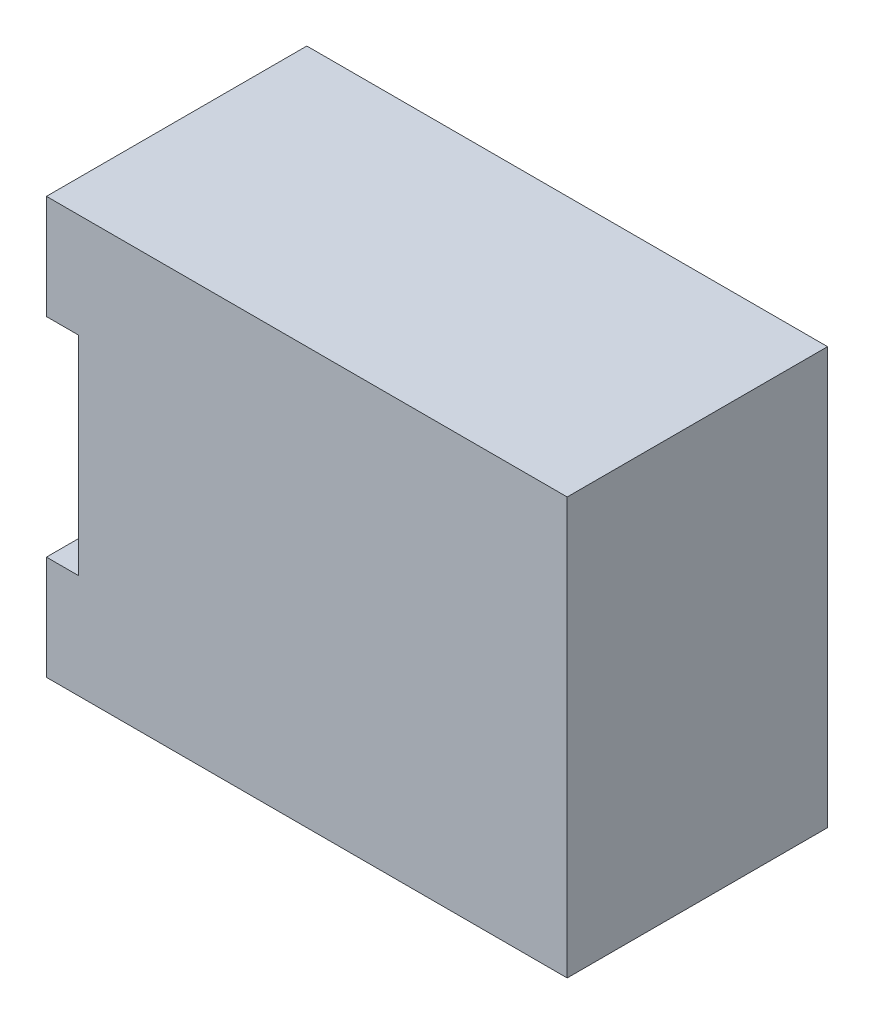
ISO-10303-21;
HEADER;
FILE_DESCRIPTION(('STEP AP214'),'2;1');
FILE_NAME('part.step','',(''),(''),'','','');
FILE_SCHEMA(('AUTOMOTIVE_DESIGN { 1 0 10303 214 1 1 1 1 }'));
ENDSEC;
DATA;
#1=APPLICATION_CONTEXT('core data for automotive mechanical design processes');
#2=APPLICATION_PROTOCOL_DEFINITION('international standard','automotive_design',2000,#1);
#3=PRODUCT_CONTEXT('',#1,'mechanical');
#4=PRODUCT('Part','Part','',(#3));
#5=PRODUCT_RELATED_PRODUCT_CATEGORY('part','',(#4));
#6=PRODUCT_DEFINITION_FORMATION('','',#4);
#7=PRODUCT_DEFINITION_CONTEXT('part definition',#1,'design');
#8=PRODUCT_DEFINITION('design','',#6,#7);
#9=PRODUCT_DEFINITION_SHAPE('','',#8);
#10=(LENGTH_UNIT() NAMED_UNIT(*) SI_UNIT(.MILLI.,.METRE.));
#11=(NAMED_UNIT(*) PLANE_ANGLE_UNIT() SI_UNIT($,.RADIAN.));
#12=(NAMED_UNIT(*) SI_UNIT($,.STERADIAN.) SOLID_ANGLE_UNIT());
#13=UNCERTAINTY_MEASURE_WITH_UNIT(LENGTH_MEASURE(1.E-05),#10,'distance_accuracy_value','');
#14=(GEOMETRIC_REPRESENTATION_CONTEXT(3) GLOBAL_UNCERTAINTY_ASSIGNED_CONTEXT((#13)) GLOBAL_UNIT_ASSIGNED_CONTEXT((#10,
#11,#12)) REPRESENTATION_CONTEXT('',''));
#15=CARTESIAN_POINT('',(0.,0.,0.));
#16=DIRECTION('',(0.,0.,1.));
#17=DIRECTION('',(1.,0.,0.));
#18=AXIS2_PLACEMENT_3D('',#15,#16,#17);
#19=CARTESIAN_POINT('',(-40.9757879880822,30.3333333333333,32.5));
#20=DIRECTION('',(1.,0.,0.));
#21=DIRECTION('',(0.,0.,-1.));
#22=AXIS2_PLACEMENT_3D('',#19,#20,#21);
#23=PLANE('',#22);
#24=DIRECTION('',(0.,-1.,0.));
#25=VECTOR('',#24,1.);
#26=CARTESIAN_POINT('',(-40.9757879880822,30.3333333333333,0.));
#27=LINE('',#26,#25);
#28=CARTESIAN_POINT('',(-40.9757879880822,30.3333333333333,0.));
#29=VERTEX_POINT('',#28);
#30=CARTESIAN_POINT('',(-40.9757879880822,17.3333333333333,0.));
#31=VERTEX_POINT('',#30);
#32=EDGE_CURVE('E128',#29,#31,#27,.T.);
#33=ORIENTED_EDGE('',*,*,#32,.T.);
#34=DIRECTION('',(0.,0.,-1.));
#35=VECTOR('',#34,1.);
#36=CARTESIAN_POINT('',(-40.9757879880822,17.3333333333333,32.5));
#37=LINE('',#36,#35);
#38=CARTESIAN_POINT('',(-40.9757879880822,17.3333333333333,32.5));
#39=VERTEX_POINT('',#38);
#40=EDGE_CURVE('E11',#39,#31,#37,.T.);
#41=ORIENTED_EDGE('',*,*,#40,.F.);
#42=DIRECTION('',(0.,-1.,0.));
#43=VECTOR('',#42,1.);
#44=CARTESIAN_POINT('',(-40.9757879880822,30.3333333333333,32.5));
#45=LINE('',#44,#43);
#46=CARTESIAN_POINT('',(-40.9757879880822,30.3333333333333,32.5));
#47=VERTEX_POINT('',#46);
#48=EDGE_CURVE('E142',#47,#39,#45,.T.);
#49=ORIENTED_EDGE('',*,*,#48,.F.);
#50=DIRECTION('',(0.,0.,-1.));
#51=VECTOR('',#50,1.);
#52=CARTESIAN_POINT('',(-40.9757879880822,30.3333333333333,32.5));
#53=LINE('',#52,#51);
#54=EDGE_CURVE('E124',#47,#29,#53,.T.);
#55=ORIENTED_EDGE('',*,*,#54,.T.);
#56=EDGE_LOOP('',(#33,#41,#49,#55));
#57=FACE_BOUND('',#56,.T.);
#58=ADVANCED_FACE('F32',(#57),#23,.F.);
#59=CARTESIAN_POINT('',(-40.9757879880822,17.3333333333333,32.5));
#60=DIRECTION('',(0.,1.,0.));
#61=DIRECTION('',(0.,0.,1.));
#62=AXIS2_PLACEMENT_3D('',#59,#60,#61);
#63=PLANE('',#62);
#64=DIRECTION('',(1.,0.,0.));
#65=VECTOR('',#64,1.);
#66=CARTESIAN_POINT('',(-40.9757879880822,17.3333333333333,0.));
#67=LINE('',#66,#65);
#68=CARTESIAN_POINT('',(-36.9757879880822,17.3333333333333,0.));
#69=VERTEX_POINT('',#68);
#70=EDGE_CURVE('E131',#31,#69,#67,.T.);
#71=ORIENTED_EDGE('',*,*,#70,.T.);
#72=DIRECTION('',(0.,0.,-1.));
#73=VECTOR('',#72,1.);
#74=CARTESIAN_POINT('',(-36.9757879880822,17.3333333333333,32.5));
#75=LINE('',#74,#73);
#76=CARTESIAN_POINT('',(-36.9757879880822,17.3333333333333,32.5));
#77=VERTEX_POINT('',#76);
#78=EDGE_CURVE('E40',#77,#69,#75,.T.);
#79=ORIENTED_EDGE('',*,*,#78,.F.);
#80=DIRECTION('',(1.,0.,0.));
#81=VECTOR('',#80,1.);
#82=CARTESIAN_POINT('',(-40.9757879880822,17.3333333333333,32.5));
#83=LINE('',#82,#81);
#84=EDGE_CURVE('E91',#39,#77,#83,.T.);
#85=ORIENTED_EDGE('',*,*,#84,.F.);
#86=ORIENTED_EDGE('',*,*,#40,.T.);
#87=EDGE_LOOP('',(#71,#79,#85,#86));
#88=FACE_BOUND('',#87,.T.);
#89=ADVANCED_FACE('F177',(#88),#63,.F.);
#90=CARTESIAN_POINT('',(-36.9757879880822,17.3333333333333,32.5));
#91=DIRECTION('',(1.,0.,0.));
#92=DIRECTION('',(0.,0.,-1.));
#93=AXIS2_PLACEMENT_3D('',#90,#91,#92);
#94=PLANE('',#93);
#95=DIRECTION('',(0.,-1.,0.));
#96=VECTOR('',#95,1.);
#97=CARTESIAN_POINT('',(-36.9757879880822,17.3333333333333,0.));
#98=LINE('',#97,#96);
#99=CARTESIAN_POINT('',(-36.9757879880822,-8.66666666666667,0.));
#100=VERTEX_POINT('',#99);
#101=EDGE_CURVE('E133',#69,#100,#98,.T.);
#102=ORIENTED_EDGE('',*,*,#101,.T.);
#103=DIRECTION('',(0.,0.,-1.));
#104=VECTOR('',#103,1.);
#105=CARTESIAN_POINT('',(-36.9757879880822,-8.66666666666667,32.5));
#106=LINE('',#105,#104);
#107=CARTESIAN_POINT('',(-36.9757879880822,-8.66666666666667,32.5));
#108=VERTEX_POINT('',#107);
#109=EDGE_CURVE('E149',#108,#100,#106,.T.);
#110=ORIENTED_EDGE('',*,*,#109,.F.);
#111=DIRECTION('',(0.,-1.,0.));
#112=VECTOR('',#111,1.);
#113=CARTESIAN_POINT('',(-36.9757879880822,17.3333333333333,32.5));
#114=LINE('',#113,#112);
#115=EDGE_CURVE('E157',#77,#108,#114,.T.);
#116=ORIENTED_EDGE('',*,*,#115,.F.);
#117=ORIENTED_EDGE('',*,*,#78,.T.);
#118=EDGE_LOOP('',(#102,#110,#116,#117));
#119=FACE_BOUND('',#118,.T.);
#120=ADVANCED_FACE('F155',(#119),#94,.F.);
#121=CARTESIAN_POINT('',(-36.9757879880822,-8.66666666666667,32.5));
#122=DIRECTION('',(0.,-1.,0.));
#123=DIRECTION('',(0.,0.,-1.));
#124=AXIS2_PLACEMENT_3D('',#121,#122,#123);
#125=PLANE('',#124);
#126=DIRECTION('',(-1.,0.,0.));
#127=VECTOR('',#126,1.);
#128=CARTESIAN_POINT('',(-36.9757879880822,-8.66666666666667,0.));
#129=LINE('',#128,#127);
#130=CARTESIAN_POINT('',(-40.9757879880822,-8.66666666666667,0.));
#131=VERTEX_POINT('',#130);
#132=EDGE_CURVE('E135',#100,#131,#129,.T.);
#133=ORIENTED_EDGE('',*,*,#132,.T.);
#134=DIRECTION('',(0.,0.,-1.));
#135=VECTOR('',#134,1.);
#136=CARTESIAN_POINT('',(-40.9757879880822,-8.66666666666667,32.5));
#137=LINE('',#136,#135);
#138=CARTESIAN_POINT('',(-40.9757879880822,-8.66666666666667,32.5));
#139=VERTEX_POINT('',#138);
#140=EDGE_CURVE('E146',#139,#131,#137,.T.);
#141=ORIENTED_EDGE('',*,*,#140,.F.);
#142=DIRECTION('',(-1.,0.,0.));
#143=VECTOR('',#142,1.);
#144=CARTESIAN_POINT('',(-36.9757879880822,-8.66666666666667,32.5));
#145=LINE('',#144,#143);
#146=EDGE_CURVE('E169',#108,#139,#145,.T.);
#147=ORIENTED_EDGE('',*,*,#146,.F.);
#148=ORIENTED_EDGE('',*,*,#109,.T.);
#149=EDGE_LOOP('',(#133,#141,#147,#148));
#150=FACE_BOUND('',#149,.T.);
#151=ADVANCED_FACE('F165',(#150),#125,.F.);
#152=CARTESIAN_POINT('',(-40.9757879880822,-8.66666666666667,32.5));
#153=DIRECTION('',(1.,0.,0.));
#154=DIRECTION('',(0.,0.,-1.));
#155=AXIS2_PLACEMENT_3D('',#152,#153,#154);
#156=PLANE('',#155);
#157=DIRECTION('',(0.,-1.,0.));
#158=VECTOR('',#157,1.);
#159=CARTESIAN_POINT('',(-40.9757879880822,-8.66666666666667,0.));
#160=LINE('',#159,#158);
#161=CARTESIAN_POINT('',(-40.9757879880822,-21.6666666666667,0.));
#162=VERTEX_POINT('',#161);
#163=EDGE_CURVE('E137',#131,#162,#160,.T.);
#164=ORIENTED_EDGE('',*,*,#163,.T.);
#165=DIRECTION('',(0.,0.,-1.));
#166=VECTOR('',#165,1.);
#167=CARTESIAN_POINT('',(-40.9757879880822,-21.6666666666667,32.5));
#168=LINE('',#167,#166);
#169=CARTESIAN_POINT('',(-40.9757879880822,-21.6666666666667,32.5));
#170=VERTEX_POINT('',#169);
#171=EDGE_CURVE('E119',#170,#162,#168,.T.);
#172=ORIENTED_EDGE('',*,*,#171,.F.);
#173=DIRECTION('',(0.,-1.,0.));
#174=VECTOR('',#173,1.);
#175=CARTESIAN_POINT('',(-40.9757879880822,-8.66666666666667,32.5));
#176=LINE('',#175,#174);
#177=EDGE_CURVE('E110',#139,#170,#176,.T.);
#178=ORIENTED_EDGE('',*,*,#177,.F.);
#179=ORIENTED_EDGE('',*,*,#140,.T.);
#180=EDGE_LOOP('',(#164,#172,#178,#179));
#181=FACE_BOUND('',#180,.T.);
#182=ADVANCED_FACE('F168',(#181),#156,.F.);
#183=CARTESIAN_POINT('',(-40.9757879880822,-21.6666666666667,32.5));
#184=DIRECTION('',(0.,1.,0.));
#185=DIRECTION('',(-1.,0.,0.));
#186=AXIS2_PLACEMENT_3D('',#183,#184,#185);
#187=PLANE('',#186);
#188=DIRECTION('',(1.,0.,0.));
#189=VECTOR('',#188,1.);
#190=CARTESIAN_POINT('',(-40.9757879880822,-21.6666666666667,0.));
#191=LINE('',#190,#189);
#192=CARTESIAN_POINT('',(24.0242120119178,-21.6666666666667,0.));
#193=VERTEX_POINT('',#192);
#194=EDGE_CURVE('E118',#162,#193,#191,.T.);
#195=ORIENTED_EDGE('',*,*,#194,.T.);
#196=DIRECTION('',(0.,0.,-1.));
#197=VECTOR('',#196,1.);
#198=CARTESIAN_POINT('',(24.0242120119178,-21.6666666666667,32.5));
#199=LINE('',#198,#197);
#200=CARTESIAN_POINT('',(24.0242120119178,-21.6666666666667,32.5));
#201=VERTEX_POINT('',#200);
#202=EDGE_CURVE('E115',#201,#193,#199,.T.);
#203=ORIENTED_EDGE('',*,*,#202,.F.);
#204=DIRECTION('',(1.,0.,0.));
#205=VECTOR('',#204,1.);
#206=CARTESIAN_POINT('',(-40.9757879880822,-21.6666666666667,32.5));
#207=LINE('',#206,#205);
#208=EDGE_CURVE('E104',#170,#201,#207,.T.);
#209=ORIENTED_EDGE('',*,*,#208,.F.);
#210=ORIENTED_EDGE('',*,*,#171,.T.);
#211=EDGE_LOOP('',(#195,#203,#209,#210));
#212=FACE_BOUND('',#211,.T.);
#213=ADVANCED_FACE('F116',(#212),#187,.F.);
#214=CARTESIAN_POINT('',(24.0242120119178,30.3333333333333,32.5));
#215=DIRECTION('',(-1.,0.,0.));
#216=DIRECTION('',(0.,0.,1.));
#217=AXIS2_PLACEMENT_3D('',#214,#215,#216);
#218=PLANE('',#217);
#219=DIRECTION('',(0.,1.,0.));
#220=VECTOR('',#219,1.);
#221=CARTESIAN_POINT('',(24.0242120119178,30.3333333333333,0.));
#222=LINE('',#221,#220);
#223=CARTESIAN_POINT('',(24.0242120119178,30.3333333333333,0.));
#224=VERTEX_POINT('',#223);
#225=EDGE_CURVE('E77',#193,#224,#222,.T.);
#226=ORIENTED_EDGE('',*,*,#225,.T.);
#227=DIRECTION('',(0.,0.,-1.));
#228=VECTOR('',#227,1.);
#229=CARTESIAN_POINT('',(24.0242120119178,30.3333333333333,32.5));
#230=LINE('',#229,#228);
#231=CARTESIAN_POINT('',(24.0242120119178,30.3333333333333,32.5));
#232=VERTEX_POINT('',#231);
#233=EDGE_CURVE('E120',#232,#224,#230,.T.);
#234=ORIENTED_EDGE('',*,*,#233,.F.);
#235=DIRECTION('',(0.,1.,0.));
#236=VECTOR('',#235,1.);
#237=CARTESIAN_POINT('',(24.0242120119178,30.3333333333333,32.5));
#238=LINE('',#237,#236);
#239=EDGE_CURVE('E108',#201,#232,#238,.T.);
#240=ORIENTED_EDGE('',*,*,#239,.F.);
#241=ORIENTED_EDGE('',*,*,#202,.T.);
#242=EDGE_LOOP('',(#226,#234,#240,#241));
#243=FACE_BOUND('',#242,.T.);
#244=ADVANCED_FACE('F122',(#243),#218,.F.);
#245=CARTESIAN_POINT('',(-40.9757879880822,30.3333333333333,32.5));
#246=DIRECTION('',(0.,-1.,0.));
#247=DIRECTION('',(0.,0.,-1.));
#248=AXIS2_PLACEMENT_3D('',#245,#246,#247);
#249=PLANE('',#248);
#250=DIRECTION('',(-1.,0.,0.));
#251=VECTOR('',#250,1.);
#252=CARTESIAN_POINT('',(-40.9757879880822,30.3333333333333,0.));
#253=LINE('',#252,#251);
#254=EDGE_CURVE('E83',#224,#29,#253,.T.);
#255=ORIENTED_EDGE('',*,*,#254,.T.);
#256=ORIENTED_EDGE('',*,*,#54,.F.);
#257=DIRECTION('',(-1.,0.,0.));
#258=VECTOR('',#257,1.);
#259=CARTESIAN_POINT('',(-40.9757879880822,30.3333333333333,32.5));
#260=LINE('',#259,#258);
#261=EDGE_CURVE('E48',#232,#47,#260,.T.);
#262=ORIENTED_EDGE('',*,*,#261,.F.);
#263=ORIENTED_EDGE('',*,*,#233,.T.);
#264=EDGE_LOOP('',(#255,#256,#262,#263));
#265=FACE_BOUND('',#264,.T.);
#266=ADVANCED_FACE('F193',(#265),#249,.F.);
#267=CARTESIAN_POINT('',(0.,0.,32.5));
#268=DIRECTION('',(0.,0.,1.));
#269=DIRECTION('',(1.,0.,0.));
#270=AXIS2_PLACEMENT_3D('',#267,#268,#269);
#271=PLANE('',#270);
#272=ORIENTED_EDGE('',*,*,#48,.T.);
#273=ORIENTED_EDGE('',*,*,#84,.T.);
#274=ORIENTED_EDGE('',*,*,#115,.T.);
#275=ORIENTED_EDGE('',*,*,#146,.T.);
#276=ORIENTED_EDGE('',*,*,#177,.T.);
#277=ORIENTED_EDGE('',*,*,#208,.T.);
#278=ORIENTED_EDGE('',*,*,#239,.T.);
#279=ORIENTED_EDGE('',*,*,#261,.T.);
#280=EDGE_LOOP('',(#272,#273,#274,#275,#276,#277,#278,#279));
#281=FACE_BOUND('',#280,.T.);
#282=ADVANCED_FACE('F106',(#281),#271,.T.);
#283=CARTESIAN_POINT('',(0.,0.,0.));
#284=DIRECTION('',(0.,0.,1.));
#285=DIRECTION('',(1.,0.,0.));
#286=AXIS2_PLACEMENT_3D('',#283,#284,#285);
#287=PLANE('',#286);
#288=ORIENTED_EDGE('',*,*,#32,.F.);
#289=ORIENTED_EDGE('',*,*,#254,.F.);
#290=ORIENTED_EDGE('',*,*,#225,.F.);
#291=ORIENTED_EDGE('',*,*,#194,.F.);
#292=ORIENTED_EDGE('',*,*,#163,.F.);
#293=ORIENTED_EDGE('',*,*,#132,.F.);
#294=ORIENTED_EDGE('',*,*,#101,.F.);
#295=ORIENTED_EDGE('',*,*,#70,.F.);
#296=EDGE_LOOP('',(#288,#289,#290,#291,#292,#293,#294,#295));
#297=FACE_BOUND('',#296,.T.);
#298=ADVANCED_FACE('F161',(#297),#287,.F.);
#299=CLOSED_SHELL('',(#58,#89,#120,#151,#182,#213,#244,#266,#282,#298));
#300=MANIFOLD_SOLID_BREP('B2',#299);
#301=ADVANCED_BREP_SHAPE_REPRESENTATION('',(#18,#300),#14);
#302=SHAPE_DEFINITION_REPRESENTATION(#9,#301);
ENDSEC;
END-ISO-10303-21;
